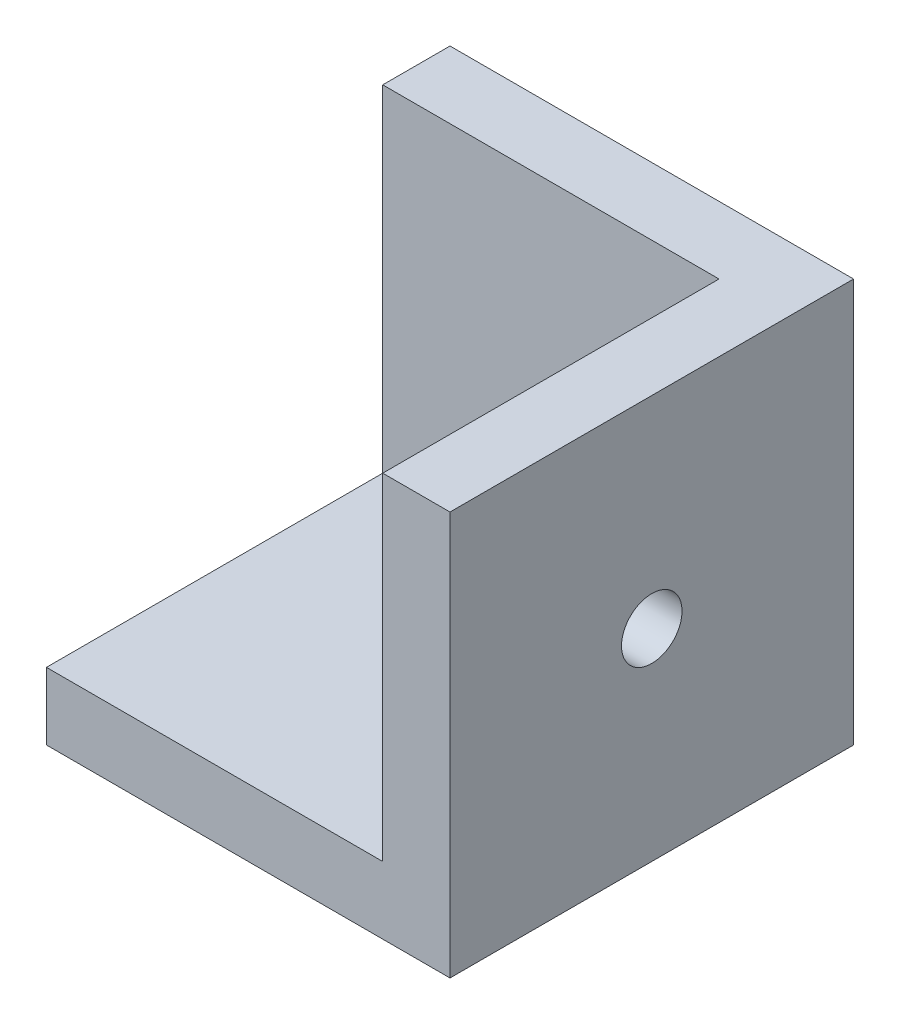
ISO-10303-21;
HEADER;
FILE_DESCRIPTION(('STEP AP214'),'2;1');
FILE_NAME('part.step','',(''),(''),'','','');
FILE_SCHEMA(('AUTOMOTIVE_DESIGN { 1 0 10303 214 1 1 1 1 }'));
ENDSEC;
DATA;
#1=APPLICATION_CONTEXT('core data for automotive mechanical design processes');
#2=APPLICATION_PROTOCOL_DEFINITION('international standard','automotive_design',2000,#1);
#3=PRODUCT_CONTEXT('',#1,'mechanical');
#4=PRODUCT('Part','Part','',(#3));
#5=PRODUCT_RELATED_PRODUCT_CATEGORY('part','',(#4));
#6=PRODUCT_DEFINITION_FORMATION('','',#4);
#7=PRODUCT_DEFINITION_CONTEXT('part definition',#1,'design');
#8=PRODUCT_DEFINITION('design','',#6,#7);
#9=PRODUCT_DEFINITION_SHAPE('','',#8);
#10=(LENGTH_UNIT() NAMED_UNIT(*) SI_UNIT(.MILLI.,.METRE.));
#11=(NAMED_UNIT(*) PLANE_ANGLE_UNIT() SI_UNIT($,.RADIAN.));
#12=(NAMED_UNIT(*) SI_UNIT($,.STERADIAN.) SOLID_ANGLE_UNIT());
#13=UNCERTAINTY_MEASURE_WITH_UNIT(LENGTH_MEASURE(1.E-05),#10,'distance_accuracy_value','');
#14=(GEOMETRIC_REPRESENTATION_CONTEXT(3) GLOBAL_UNCERTAINTY_ASSIGNED_CONTEXT((#13)) GLOBAL_UNIT_ASSIGNED_CONTEXT((#10,
#11,#12)) REPRESENTATION_CONTEXT('',''));
#15=CARTESIAN_POINT('',(0.,0.,0.));
#16=DIRECTION('',(0.,0.,1.));
#17=DIRECTION('',(1.,0.,0.));
#18=AXIS2_PLACEMENT_3D('',#15,#16,#17);
#19=CARTESIAN_POINT('',(0.,0.,30.));
#20=DIRECTION('',(-1.,0.,0.));
#21=DIRECTION('',(0.,0.,1.));
#22=AXIS2_PLACEMENT_3D('',#19,#20,#21);
#23=PLANE('',#22);
#24=CARTESIAN_POINT('',(0.,15.,15.));
#25=DIRECTION('',(-1.,0.,0.));
#26=DIRECTION('',(0.,0.,1.));
#27=AXIS2_PLACEMENT_3D('',#24,#25,#26);
#28=CIRCLE('',#27,2.25);
#29=CARTESIAN_POINT('',(0.,15.,17.25));
#30=VERTEX_POINT('',#29);
#31=EDGE_CURVE('E189',#30,#30,#28,.T.);
#32=ORIENTED_EDGE('',*,*,#31,.T.);
#33=EDGE_LOOP('',(#32));
#34=FACE_BOUND('',#33,.T.);
#35=DIRECTION('',(0.,1.,0.));
#36=VECTOR('',#35,1.);
#37=CARTESIAN_POINT('',(0.,0.,0.));
#38=LINE('',#37,#36);
#39=CARTESIAN_POINT('',(0.,0.,0.));
#40=VERTEX_POINT('',#39);
#41=CARTESIAN_POINT('',(0.,30.,0.));
#42=VERTEX_POINT('',#41);
#43=EDGE_CURVE('E135',#40,#42,#38,.T.);
#44=ORIENTED_EDGE('',*,*,#43,.T.);
#45=DIRECTION('',(0.,0.,-1.));
#46=VECTOR('',#45,1.);
#47=CARTESIAN_POINT('',(0.,30.,30.));
#48=LINE('',#47,#46);
#49=CARTESIAN_POINT('',(0.,30.,30.));
#50=VERTEX_POINT('',#49);
#51=EDGE_CURVE('E11',#50,#42,#48,.T.);
#52=ORIENTED_EDGE('',*,*,#51,.F.);
#53=DIRECTION('',(0.,1.,0.));
#54=VECTOR('',#53,1.);
#55=CARTESIAN_POINT('',(0.,0.,30.));
#56=LINE('',#55,#54);
#57=CARTESIAN_POINT('',(0.,0.,30.));
#58=VERTEX_POINT('',#57);
#59=EDGE_CURVE('E137',#58,#50,#56,.T.);
#60=ORIENTED_EDGE('',*,*,#59,.F.);
#61=DIRECTION('',(0.,0.,-1.));
#62=VECTOR('',#61,1.);
#63=CARTESIAN_POINT('',(0.,0.,30.));
#64=LINE('',#63,#62);
#65=EDGE_CURVE('E143',#58,#40,#64,.T.);
#66=ORIENTED_EDGE('',*,*,#65,.T.);
#67=EDGE_LOOP('',(#44,#52,#60,#66));
#68=FACE_BOUND('',#67,.T.);
#69=ADVANCED_FACE('F37',(#34,#68),#23,.F.);
#70=CARTESIAN_POINT('',(0.,30.,30.));
#71=DIRECTION('',(0.,-1.,0.));
#72=DIRECTION('',(1.,0.,0.));
#73=AXIS2_PLACEMENT_3D('',#70,#71,#72);
#74=PLANE('',#73);
#75=DIRECTION('',(-1.,0.,0.));
#76=VECTOR('',#75,1.);
#77=CARTESIAN_POINT('',(-5.,30.,5.));
#78=LINE('',#77,#76);
#79=CARTESIAN_POINT('',(-5.,30.,5.));
#80=VERTEX_POINT('',#79);
#81=CARTESIAN_POINT('',(-30.,30.,5.));
#82=VERTEX_POINT('',#81);
#83=EDGE_CURVE('E123',#80,#82,#78,.T.);
#84=ORIENTED_EDGE('',*,*,#83,.F.);
#85=DIRECTION('',(0.,0.,-1.));
#86=VECTOR('',#85,1.);
#87=CARTESIAN_POINT('',(-5.,30.,5.));
#88=LINE('',#87,#86);
#89=CARTESIAN_POINT('',(-5.,30.,30.));
#90=VERTEX_POINT('',#89);
#91=EDGE_CURVE('E111',#90,#80,#88,.T.);
#92=ORIENTED_EDGE('',*,*,#91,.F.);
#93=DIRECTION('',(-1.,0.,0.));
#94=VECTOR('',#93,1.);
#95=CARTESIAN_POINT('',(0.,30.,30.));
#96=LINE('',#95,#94);
#97=EDGE_CURVE('E86',#50,#90,#96,.T.);
#98=ORIENTED_EDGE('',*,*,#97,.F.);
#99=ORIENTED_EDGE('',*,*,#51,.T.);
#100=DIRECTION('',(-1.,0.,0.));
#101=VECTOR('',#100,1.);
#102=CARTESIAN_POINT('',(0.,30.,0.));
#103=LINE('',#102,#101);
#104=CARTESIAN_POINT('',(-30.,30.,0.));
#105=VERTEX_POINT('',#104);
#106=EDGE_CURVE('E146',#42,#105,#103,.T.);
#107=ORIENTED_EDGE('',*,*,#106,.T.);
#108=DIRECTION('',(0.,0.,-1.));
#109=VECTOR('',#108,1.);
#110=CARTESIAN_POINT('',(-30.,30.,30.));
#111=LINE('',#110,#109);
#112=EDGE_CURVE('E44',#82,#105,#111,.T.);
#113=ORIENTED_EDGE('',*,*,#112,.F.);
#114=EDGE_LOOP('',(#84,#92,#98,#99,#107,#113));
#115=FACE_BOUND('',#114,.T.);
#116=ADVANCED_FACE('F159',(#115),#74,.F.);
#117=CARTESIAN_POINT('',(-30.,0.,30.));
#118=DIRECTION('',(1.,0.,0.));
#119=DIRECTION('',(0.,0.,-1.));
#120=AXIS2_PLACEMENT_3D('',#117,#118,#119);
#121=PLANE('',#120);
#122=DIRECTION('',(0.,0.,1.));
#123=VECTOR('',#122,1.);
#124=CARTESIAN_POINT('',(-30.,5.,5.));
#125=LINE('',#124,#123);
#126=CARTESIAN_POINT('',(-30.,5.,5.));
#127=VERTEX_POINT('',#126);
#128=CARTESIAN_POINT('',(-30.,5.,30.));
#129=VERTEX_POINT('',#128);
#130=EDGE_CURVE('E51',#127,#129,#125,.T.);
#131=ORIENTED_EDGE('',*,*,#130,.F.);
#132=DIRECTION('',(0.,1.,0.));
#133=VECTOR('',#132,1.);
#134=CARTESIAN_POINT('',(-30.,5.,5.));
#135=LINE('',#134,#133);
#136=EDGE_CURVE('E114',#127,#82,#135,.T.);
#137=ORIENTED_EDGE('',*,*,#136,.T.);
#138=ORIENTED_EDGE('',*,*,#112,.T.);
#139=DIRECTION('',(0.,-1.,0.));
#140=VECTOR('',#139,1.);
#141=CARTESIAN_POINT('',(-30.,0.,0.));
#142=LINE('',#141,#140);
#143=CARTESIAN_POINT('',(-30.,0.,0.));
#144=VERTEX_POINT('',#143);
#145=EDGE_CURVE('E149',#105,#144,#142,.T.);
#146=ORIENTED_EDGE('',*,*,#145,.T.);
#147=DIRECTION('',(0.,0.,-1.));
#148=VECTOR('',#147,1.);
#149=CARTESIAN_POINT('',(-30.,0.,30.));
#150=LINE('',#149,#148);
#151=CARTESIAN_POINT('',(-30.,0.,30.));
#152=VERTEX_POINT('',#151);
#153=EDGE_CURVE('E153',#152,#144,#150,.T.);
#154=ORIENTED_EDGE('',*,*,#153,.F.);
#155=DIRECTION('',(0.,-1.,0.));
#156=VECTOR('',#155,1.);
#157=CARTESIAN_POINT('',(-30.,0.,30.));
#158=LINE('',#157,#156);
#159=EDGE_CURVE('E140',#129,#152,#158,.T.);
#160=ORIENTED_EDGE('',*,*,#159,.F.);
#161=EDGE_LOOP('',(#131,#137,#138,#146,#154,#160));
#162=FACE_BOUND('',#161,.T.);
#163=ADVANCED_FACE('F156',(#162),#121,.F.);
#164=CARTESIAN_POINT('',(0.,0.,30.));
#165=DIRECTION('',(0.,1.,0.));
#166=DIRECTION('',(-1.,0.,0.));
#167=AXIS2_PLACEMENT_3D('',#164,#165,#166);
#168=PLANE('',#167);
#169=CARTESIAN_POINT('',(-15.,0.,15.));
#170=DIRECTION('',(0.,1.,0.));
#171=DIRECTION('',(0.,0.,1.));
#172=AXIS2_PLACEMENT_3D('',#169,#170,#171);
#173=CIRCLE('',#172,2.25);
#174=CARTESIAN_POINT('',(-15.,0.,17.25));
#175=VERTEX_POINT('',#174);
#176=EDGE_CURVE('E127',#175,#175,#173,.T.);
#177=ORIENTED_EDGE('',*,*,#176,.T.);
#178=EDGE_LOOP('',(#177));
#179=FACE_BOUND('',#178,.T.);
#180=DIRECTION('',(1.,0.,0.));
#181=VECTOR('',#180,1.);
#182=CARTESIAN_POINT('',(0.,0.,0.));
#183=LINE('',#182,#181);
#184=EDGE_CURVE('E80',#144,#40,#183,.T.);
#185=ORIENTED_EDGE('',*,*,#184,.T.);
#186=ORIENTED_EDGE('',*,*,#65,.F.);
#187=DIRECTION('',(1.,0.,0.));
#188=VECTOR('',#187,1.);
#189=CARTESIAN_POINT('',(0.,0.,30.));
#190=LINE('',#189,#188);
#191=EDGE_CURVE('E60',#152,#58,#190,.T.);
#192=ORIENTED_EDGE('',*,*,#191,.F.);
#193=ORIENTED_EDGE('',*,*,#153,.T.);
#194=EDGE_LOOP('',(#185,#186,#192,#193));
#195=FACE_BOUND('',#194,.T.);
#196=ADVANCED_FACE('F166',(#179,#195),#168,.F.);
#197=CARTESIAN_POINT('',(0.,0.,30.));
#198=DIRECTION('',(0.,0.,1.));
#199=DIRECTION('',(1.,0.,0.));
#200=AXIS2_PLACEMENT_3D('',#197,#198,#199);
#201=PLANE('',#200);
#202=DIRECTION('',(0.,1.,0.));
#203=VECTOR('',#202,1.);
#204=CARTESIAN_POINT('',(-5.,5.,30.));
#205=LINE('',#204,#203);
#206=CARTESIAN_POINT('',(-5.,5.,30.));
#207=VERTEX_POINT('',#206);
#208=EDGE_CURVE('E133',#207,#90,#205,.T.);
#209=ORIENTED_EDGE('',*,*,#208,.F.);
#210=DIRECTION('',(1.,0.,0.));
#211=VECTOR('',#210,1.);
#212=CARTESIAN_POINT('',(-5.,5.,30.));
#213=LINE('',#212,#211);
#214=EDGE_CURVE('E115',#129,#207,#213,.T.);
#215=ORIENTED_EDGE('',*,*,#214,.F.);
#216=ORIENTED_EDGE('',*,*,#159,.T.);
#217=ORIENTED_EDGE('',*,*,#191,.T.);
#218=ORIENTED_EDGE('',*,*,#59,.T.);
#219=ORIENTED_EDGE('',*,*,#97,.T.);
#220=EDGE_LOOP('',(#209,#215,#216,#217,#218,#219));
#221=FACE_BOUND('',#220,.T.);
#222=ADVANCED_FACE('F168',(#221),#201,.T.);
#223=CARTESIAN_POINT('',(0.,0.,0.));
#224=DIRECTION('',(0.,0.,1.));
#225=DIRECTION('',(1.,0.,0.));
#226=AXIS2_PLACEMENT_3D('',#223,#224,#225);
#227=PLANE('',#226);
#228=CARTESIAN_POINT('',(-15.0012930694785,10.9960706533537,0.));
#229=DIRECTION('',(0.,0.,-1.));
#230=DIRECTION('',(-1.,0.,0.));
#231=AXIS2_PLACEMENT_3D('',#228,#229,#230);
#232=CIRCLE('',#231,1.69999999999999);
#233=CARTESIAN_POINT('',(-16.7012930694785,10.9960706533537,0.));
#234=VERTEX_POINT('',#233);
#235=EDGE_CURVE('E201',#234,#234,#232,.T.);
#236=ORIENTED_EDGE('',*,*,#235,.F.);
#237=EDGE_LOOP('',(#236));
#238=FACE_BOUND('',#237,.T.);
#239=ORIENTED_EDGE('',*,*,#43,.F.);
#240=ORIENTED_EDGE('',*,*,#184,.F.);
#241=ORIENTED_EDGE('',*,*,#145,.F.);
#242=ORIENTED_EDGE('',*,*,#106,.F.);
#243=EDGE_LOOP('',(#239,#240,#241,#242));
#244=FACE_BOUND('',#243,.T.);
#245=ADVANCED_FACE('F163',(#238,#244),#227,.F.);
#246=CARTESIAN_POINT('',(-5.,5.,5.));
#247=DIRECTION('',(1.,0.,0.));
#248=DIRECTION('',(0.,0.,-1.));
#249=AXIS2_PLACEMENT_3D('',#246,#247,#248);
#250=PLANE('',#249);
#251=CARTESIAN_POINT('',(-5.,15.,15.));
#252=DIRECTION('',(-1.,0.,0.));
#253=DIRECTION('',(0.,0.,1.));
#254=AXIS2_PLACEMENT_3D('',#251,#252,#253);
#255=CIRCLE('',#254,2.25);
#256=CARTESIAN_POINT('',(-5.,15.,17.25));
#257=VERTEX_POINT('',#256);
#258=EDGE_CURVE('E192',#257,#257,#255,.T.);
#259=ORIENTED_EDGE('',*,*,#258,.F.);
#260=EDGE_LOOP('',(#259));
#261=FACE_BOUND('',#260,.T.);
#262=ORIENTED_EDGE('',*,*,#91,.T.);
#263=DIRECTION('',(0.,1.,0.));
#264=VECTOR('',#263,1.);
#265=CARTESIAN_POINT('',(-5.,5.,5.));
#266=LINE('',#265,#264);
#267=CARTESIAN_POINT('',(-5.,5.,5.));
#268=VERTEX_POINT('',#267);
#269=EDGE_CURVE('E106',#268,#80,#266,.T.);
#270=ORIENTED_EDGE('',*,*,#269,.F.);
#271=DIRECTION('',(0.,0.,-1.));
#272=VECTOR('',#271,1.);
#273=CARTESIAN_POINT('',(-5.,5.,5.));
#274=LINE('',#273,#272);
#275=EDGE_CURVE('E110',#207,#268,#274,.T.);
#276=ORIENTED_EDGE('',*,*,#275,.F.);
#277=ORIENTED_EDGE('',*,*,#208,.T.);
#278=EDGE_LOOP('',(#262,#270,#276,#277));
#279=FACE_BOUND('',#278,.T.);
#280=ADVANCED_FACE('F108',(#261,#279),#250,.F.);
#281=CARTESIAN_POINT('',(-5.,5.,5.));
#282=DIRECTION('',(0.,0.,-1.));
#283=DIRECTION('',(-1.,0.,0.));
#284=AXIS2_PLACEMENT_3D('',#281,#282,#283);
#285=PLANE('',#284);
#286=CARTESIAN_POINT('',(-15.0012930694785,10.9960706533537,5.));
#287=DIRECTION('',(0.,0.,-1.));
#288=DIRECTION('',(-1.,0.,0.));
#289=AXIS2_PLACEMENT_3D('',#286,#287,#288);
#290=CIRCLE('',#289,1.69999999999999);
#291=CARTESIAN_POINT('',(-16.7012930694785,10.9960706533537,5.));
#292=VERTEX_POINT('',#291);
#293=EDGE_CURVE('E196',#292,#292,#290,.T.);
#294=ORIENTED_EDGE('',*,*,#293,.T.);
#295=EDGE_LOOP('',(#294));
#296=FACE_BOUND('',#295,.T.);
#297=ORIENTED_EDGE('',*,*,#83,.T.);
#298=ORIENTED_EDGE('',*,*,#136,.F.);
#299=DIRECTION('',(-1.,0.,0.));
#300=VECTOR('',#299,1.);
#301=CARTESIAN_POINT('',(-5.,5.,5.));
#302=LINE('',#301,#300);
#303=EDGE_CURVE('E117',#268,#127,#302,.T.);
#304=ORIENTED_EDGE('',*,*,#303,.F.);
#305=ORIENTED_EDGE('',*,*,#269,.T.);
#306=EDGE_LOOP('',(#297,#298,#304,#305));
#307=FACE_BOUND('',#306,.T.);
#308=ADVANCED_FACE('F118',(#296,#307),#285,.F.);
#309=CARTESIAN_POINT('',(0.,5.,0.));
#310=DIRECTION('',(0.,-1.,0.));
#311=DIRECTION('',(0.,0.,-1.));
#312=AXIS2_PLACEMENT_3D('',#309,#310,#311);
#313=PLANE('',#312);
#314=CARTESIAN_POINT('',(-15.,5.,15.));
#315=DIRECTION('',(0.,1.,0.));
#316=DIRECTION('',(0.,0.,1.));
#317=AXIS2_PLACEMENT_3D('',#314,#315,#316);
#318=CIRCLE('',#317,2.25);
#319=CARTESIAN_POINT('',(-15.,5.,17.25));
#320=VERTEX_POINT('',#319);
#321=EDGE_CURVE('E191',#320,#320,#318,.T.);
#322=ORIENTED_EDGE('',*,*,#321,.F.);
#323=EDGE_LOOP('',(#322));
#324=FACE_BOUND('',#323,.T.);
#325=ORIENTED_EDGE('',*,*,#275,.T.);
#326=ORIENTED_EDGE('',*,*,#303,.T.);
#327=ORIENTED_EDGE('',*,*,#130,.T.);
#328=ORIENTED_EDGE('',*,*,#214,.T.);
#329=EDGE_LOOP('',(#325,#326,#327,#328));
#330=FACE_BOUND('',#329,.T.);
#331=ADVANCED_FACE('F121',(#324,#330),#313,.F.);
#332=CARTESIAN_POINT('',(-15.,5.,15.));
#333=DIRECTION('',(0.,1.,0.));
#334=DIRECTION('',(0.,0.,1.));
#335=AXIS2_PLACEMENT_3D('',#332,#333,#334);
#336=CYLINDRICAL_SURFACE('',#335,2.25);
#337=ORIENTED_EDGE('',*,*,#176,.F.);
#338=EDGE_LOOP('',(#337));
#339=FACE_BOUND('',#338,.T.);
#340=ORIENTED_EDGE('',*,*,#321,.T.);
#341=EDGE_LOOP('',(#340));
#342=FACE_BOUND('',#341,.T.);
#343=ADVANCED_FACE('F218',(#339,#342),#336,.F.);
#344=CARTESIAN_POINT('',(-5.,15.,15.));
#345=DIRECTION('',(-1.,0.,0.));
#346=DIRECTION('',(0.,0.,1.));
#347=AXIS2_PLACEMENT_3D('',#344,#345,#346);
#348=CYLINDRICAL_SURFACE('',#347,2.25);
#349=ORIENTED_EDGE('',*,*,#31,.F.);
#350=EDGE_LOOP('',(#349));
#351=FACE_BOUND('',#350,.T.);
#352=ORIENTED_EDGE('',*,*,#258,.T.);
#353=EDGE_LOOP('',(#352));
#354=FACE_BOUND('',#353,.T.);
#355=ADVANCED_FACE('F208',(#351,#354),#348,.F.);
#356=CARTESIAN_POINT('',(-15.0012930694785,10.9960706533537,0.));
#357=DIRECTION('',(0.,0.,-1.));
#358=DIRECTION('',(-1.,0.,0.));
#359=AXIS2_PLACEMENT_3D('',#356,#357,#358);
#360=CYLINDRICAL_SURFACE('',#359,1.69999999999999);
#361=ORIENTED_EDGE('',*,*,#235,.T.);
#362=EDGE_LOOP('',(#361));
#363=FACE_BOUND('',#362,.T.);
#364=ORIENTED_EDGE('',*,*,#293,.F.);
#365=EDGE_LOOP('',(#364));
#366=FACE_BOUND('',#365,.T.);
#367=ADVANCED_FACE('F205',(#363,#366),#360,.F.);
#368=CLOSED_SHELL('',(#69,#116,#163,#196,#222,#245,#280,#308,#331,#343,#355,#367));
#369=MANIFOLD_SOLID_BREP('B2',#368);
#370=ADVANCED_BREP_SHAPE_REPRESENTATION('',(#18,#369),#14);
#371=SHAPE_DEFINITION_REPRESENTATION(#9,#370);
ENDSEC;
END-ISO-10303-21;
